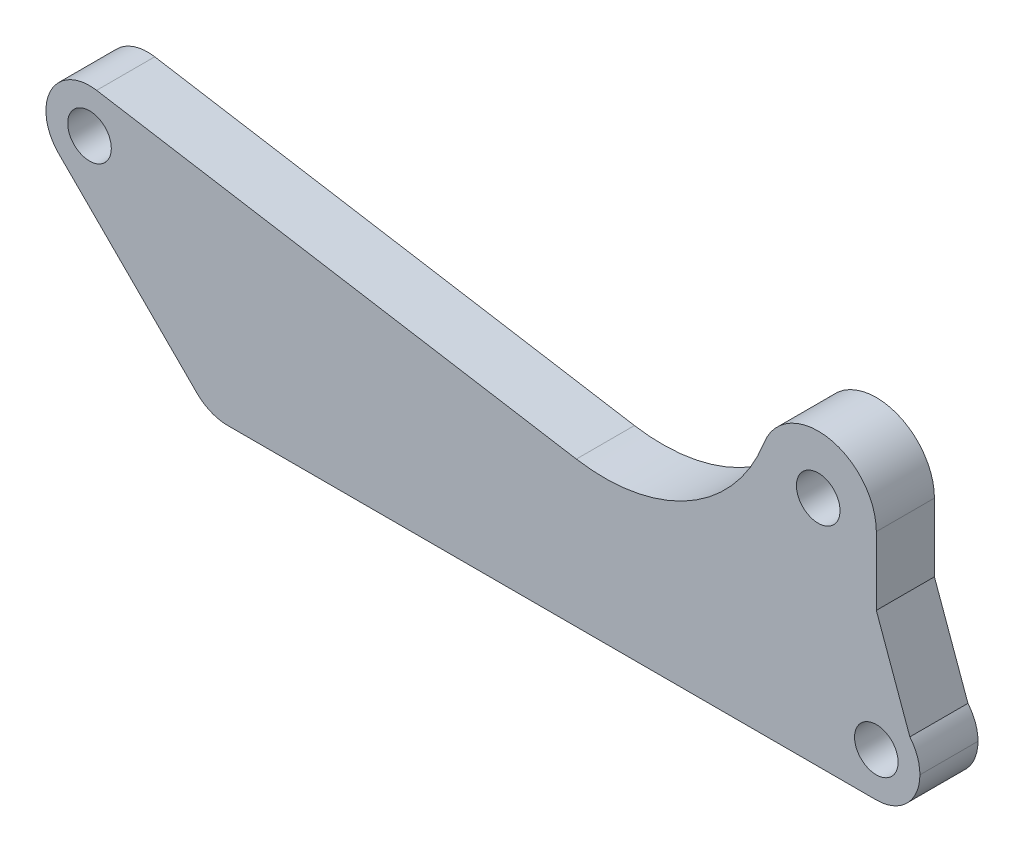
ISO-10303-21;
HEADER;
FILE_DESCRIPTION(('STEP AP214'),'2;1');
FILE_NAME('part.step','',(''),(''),'','','');
FILE_SCHEMA(('AUTOMOTIVE_DESIGN { 1 0 10303 214 1 1 1 1 }'));
ENDSEC;
DATA;
#1=APPLICATION_CONTEXT('core data for automotive mechanical design processes');
#2=APPLICATION_PROTOCOL_DEFINITION('international standard','automotive_design',2000,#1);
#3=PRODUCT_CONTEXT('',#1,'mechanical');
#4=PRODUCT('Part','Part','',(#3));
#5=PRODUCT_RELATED_PRODUCT_CATEGORY('part','',(#4));
#6=PRODUCT_DEFINITION_FORMATION('','',#4);
#7=PRODUCT_DEFINITION_CONTEXT('part definition',#1,'design');
#8=PRODUCT_DEFINITION('design','',#6,#7);
#9=PRODUCT_DEFINITION_SHAPE('','',#8);
#10=(LENGTH_UNIT() NAMED_UNIT(*) SI_UNIT(.MILLI.,.METRE.));
#11=(NAMED_UNIT(*) PLANE_ANGLE_UNIT() SI_UNIT($,.RADIAN.));
#12=(NAMED_UNIT(*) SI_UNIT($,.STERADIAN.) SOLID_ANGLE_UNIT());
#13=UNCERTAINTY_MEASURE_WITH_UNIT(LENGTH_MEASURE(1.E-05),#10,'distance_accuracy_value','');
#14=(GEOMETRIC_REPRESENTATION_CONTEXT(3) GLOBAL_UNCERTAINTY_ASSIGNED_CONTEXT((#13)) GLOBAL_UNIT_ASSIGNED_CONTEXT((#10,
#11,#12)) REPRESENTATION_CONTEXT('',''));
#15=CARTESIAN_POINT('',(0.,0.,0.));
#16=DIRECTION('',(0.,0.,1.));
#17=DIRECTION('',(1.,0.,0.));
#18=AXIS2_PLACEMENT_3D('',#15,#16,#17);
#19=CARTESIAN_POINT('',(-8.27098450185369,12.5136251889729,4.));
#20=DIRECTION('',(0.,0.,-1.));
#21=DIRECTION('',(-1.,0.,0.));
#22=AXIS2_PLACEMENT_3D('',#19,#20,#21);
#23=PLANE('',#22);
#24=DIRECTION('',(0.707106781186552,-0.707106781186543,0.));
#25=VECTOR('',#24,1.);
#26=CARTESIAN_POINT('',(0.,0.,4.));
#27=LINE('',#26,#25);
#28=CARTESIAN_POINT('',(-10.3923048454133,10.3923048454132,4.));
#29=VERTEX_POINT('',#28);
#30=CARTESIAN_POINT('',(-0.878679656440355,0.878679656440345,4.));
#31=VERTEX_POINT('',#30);
#32=EDGE_CURVE('E178',#29,#31,#27,.T.);
#33=ORIENTED_EDGE('',*,*,#32,.T.);
#34=CARTESIAN_POINT('',(1.24264068711928,3.,4.));
#35=DIRECTION('',(0.,0.,-1.));
#36=DIRECTION('',(-1.,0.,0.));
#37=AXIS2_PLACEMENT_3D('',#34,#35,#36);
#38=CIRCLE('',#37,3.);
#39=CARTESIAN_POINT('',(1.24264068711928,0.,4.));
#40=VERTEX_POINT('',#39);
#41=EDGE_CURVE('E206',#31,#40,#38,.F.);
#42=ORIENTED_EDGE('',*,*,#41,.T.);
#43=DIRECTION('',(1.,0.,0.));
#44=VECTOR('',#43,1.);
#45=CARTESIAN_POINT('',(0.,0.,4.));
#46=LINE('',#45,#44);
#47=CARTESIAN_POINT('',(45.89995730059,0.,4.));
#48=VERTEX_POINT('',#47);
#49=EDGE_CURVE('E133',#40,#48,#46,.T.);
#50=ORIENTED_EDGE('',*,*,#49,.T.);
#51=CARTESIAN_POINT('',(45.89995730059,3.,4.));
#52=DIRECTION('',(0.,0.,-1.));
#53=DIRECTION('',(-1.,0.,0.));
#54=AXIS2_PLACEMENT_3D('',#51,#52,#53);
#55=CIRCLE('',#54,3.);
#56=CARTESIAN_POINT('',(48.89995730059,3.,4.));
#57=VERTEX_POINT('',#56);
#58=EDGE_CURVE('E204',#48,#57,#55,.F.);
#59=ORIENTED_EDGE('',*,*,#58,.T.);
#60=CARTESIAN_POINT('',(45.89995730059,3.,4.));
#61=DIRECTION('',(0.,0.,-1.));
#62=DIRECTION('',(-1.,0.,0.));
#63=AXIS2_PLACEMENT_3D('',#60,#61,#62);
#64=CIRCLE('',#63,3.);
#65=CARTESIAN_POINT('',(48.2076496082823,4.91691319913492,4.));
#66=VERTEX_POINT('',#65);
#67=EDGE_CURVE('E202',#57,#66,#64,.F.);
#68=ORIENTED_EDGE('',*,*,#67,.T.);
#69=DIRECTION('',(-0.339683110243367,0.940539943125964,0.));
#70=VECTOR('',#69,1.);
#71=CARTESIAN_POINT('',(39.2638445534785,29.6811880303093,4.));
#72=LINE('',#71,#70);
#73=CARTESIAN_POINT('',(45.89995730059,11.3066238629183,4.));
#74=VERTEX_POINT('',#73);
#75=EDGE_CURVE('E11',#66,#74,#72,.T.);
#76=ORIENTED_EDGE('',*,*,#75,.T.);
#77=DIRECTION('',(0.,1.,0.));
#78=VECTOR('',#77,1.);
#79=CARTESIAN_POINT('',(45.89995730059,6.,4.));
#80=LINE('',#79,#78);
#81=CARTESIAN_POINT('',(45.89995730059,16.,4.));
#82=VERTEX_POINT('',#81);
#83=EDGE_CURVE('E122',#74,#82,#80,.T.);
#84=ORIENTED_EDGE('',*,*,#83,.T.);
#85=CARTESIAN_POINT('',(41.89995730059,16.,4.));
#86=DIRECTION('',(0.,0.,1.));
#87=DIRECTION('',(-1.,0.,0.));
#88=AXIS2_PLACEMENT_3D('',#85,#86,#87);
#89=CIRCLE('',#88,4.);
#90=CARTESIAN_POINT('',(38.1611913827208,17.4218401497283,4.));
#91=VERTEX_POINT('',#90);
#92=EDGE_CURVE('E127',#82,#91,#89,.T.);
#93=ORIENTED_EDGE('',*,*,#92,.T.);
#94=CARTESIAN_POINT('',(27.1687942559165,21.6022119408448,4.));
#95=DIRECTION('',(0.,0.,-1.));
#96=DIRECTION('',(1.,0.,0.));
#97=AXIS2_PLACEMENT_3D('',#94,#95,#96);
#98=CIRCLE('',#97,11.7604550466952);
#99=CARTESIAN_POINT('',(25.2460407654616,10.,4.));
#100=VERTEX_POINT('',#99);
#101=EDGE_CURVE('E148',#91,#100,#98,.T.);
#102=ORIENTED_EDGE('',*,*,#101,.T.);
#103=DIRECTION('',(-0.986544474238278,0.163493120191399,0.));
#104=VECTOR('',#103,1.);
#105=CARTESIAN_POINT('',(-7.7805051412795,15.4732586116877,4.));
#106=LINE('',#105,#104);
#107=CARTESIAN_POINT('',(-7.7805051412795,15.4732586116877,4.));
#108=VERTEX_POINT('',#107);
#109=EDGE_CURVE('E152',#100,#108,#106,.T.);
#110=ORIENTED_EDGE('',*,*,#109,.T.);
#111=CARTESIAN_POINT('',(-8.27098450185369,12.5136251889729,4.));
#112=DIRECTION('',(0.,0.,1.));
#113=DIRECTION('',(-1.,0.,0.));
#114=AXIS2_PLACEMENT_3D('',#111,#112,#113);
#115=CIRCLE('',#114,3.);
#116=EDGE_CURVE('E157',#108,#29,#115,.T.);
#117=ORIENTED_EDGE('',*,*,#116,.T.);
#118=EDGE_LOOP('',(#33,#42,#50,#59,#68,#76,#84,#93,#102,#110,#117));
#119=FACE_BOUND('',#118,.T.);
#120=CARTESIAN_POINT('',(41.89995730059,16.,4.));
#121=DIRECTION('',(0.,0.,1.));
#122=DIRECTION('',(1.,0.,0.));
#123=AXIS2_PLACEMENT_3D('',#120,#121,#122);
#124=CIRCLE('',#123,1.5);
#125=CARTESIAN_POINT('',(43.39995730059,16.,4.));
#126=VERTEX_POINT('',#125);
#127=EDGE_CURVE('E164',#126,#126,#124,.T.);
#128=ORIENTED_EDGE('',*,*,#127,.F.);
#129=EDGE_LOOP('',(#128));
#130=FACE_BOUND('',#129,.T.);
#131=CARTESIAN_POINT('',(-8.27098450185369,12.5136251889729,4.));
#132=DIRECTION('',(0.,0.,1.));
#133=DIRECTION('',(1.,0.,0.));
#134=AXIS2_PLACEMENT_3D('',#131,#132,#133);
#135=CIRCLE('',#134,1.50000000000001);
#136=CARTESIAN_POINT('',(-6.77098450185369,12.5136251889729,4.));
#137=VERTEX_POINT('',#136);
#138=EDGE_CURVE('E245',#137,#137,#135,.T.);
#139=ORIENTED_EDGE('',*,*,#138,.F.);
#140=EDGE_LOOP('',(#139));
#141=FACE_BOUND('',#140,.T.);
#142=CARTESIAN_POINT('',(45.89995730059,2.99999999999996,4.));
#143=DIRECTION('',(0.,0.,1.));
#144=DIRECTION('',(1.,0.,0.));
#145=AXIS2_PLACEMENT_3D('',#142,#143,#144);
#146=CIRCLE('',#145,1.50000000000002);
#147=CARTESIAN_POINT('',(47.39995730059,2.99999999999996,4.));
#148=VERTEX_POINT('',#147);
#149=EDGE_CURVE('E251',#148,#148,#146,.T.);
#150=ORIENTED_EDGE('',*,*,#149,.F.);
#151=EDGE_LOOP('',(#150));
#152=FACE_BOUND('',#151,.T.);
#153=ADVANCED_FACE('F39',(#119,#130,#141,#152),#23,.F.);
#154=CARTESIAN_POINT('',(-8.27098450185369,12.5136251889729,0.));
#155=DIRECTION('',(0.,0.,-1.));
#156=DIRECTION('',(-1.,0.,0.));
#157=AXIS2_PLACEMENT_3D('',#154,#155,#156);
#158=PLANE('',#157);
#159=CARTESIAN_POINT('',(-8.27098450185369,12.5136251889729,0.));
#160=DIRECTION('',(0.,0.,1.));
#161=DIRECTION('',(1.,0.,0.));
#162=AXIS2_PLACEMENT_3D('',#159,#160,#161);
#163=CIRCLE('',#162,1.50000000000001);
#164=CARTESIAN_POINT('',(-6.77098450185369,12.5136251889729,0.));
#165=VERTEX_POINT('',#164);
#166=EDGE_CURVE('E248',#165,#165,#163,.T.);
#167=ORIENTED_EDGE('',*,*,#166,.T.);
#168=EDGE_LOOP('',(#167));
#169=FACE_BOUND('',#168,.T.);
#170=DIRECTION('',(1.,0.,0.));
#171=VECTOR('',#170,1.);
#172=CARTESIAN_POINT('',(0.,0.,0.));
#173=LINE('',#172,#171);
#174=CARTESIAN_POINT('',(1.24264068711928,0.,0.));
#175=VERTEX_POINT('',#174);
#176=CARTESIAN_POINT('',(45.89995730059,0.,0.));
#177=VERTEX_POINT('',#176);
#178=EDGE_CURVE('E163',#175,#177,#173,.T.);
#179=ORIENTED_EDGE('',*,*,#178,.F.);
#180=CARTESIAN_POINT('',(1.24264068711928,3.,0.));
#181=DIRECTION('',(0.,0.,-1.));
#182=DIRECTION('',(-1.,0.,0.));
#183=AXIS2_PLACEMENT_3D('',#180,#181,#182);
#184=CIRCLE('',#183,3.);
#185=CARTESIAN_POINT('',(-0.878679656440355,0.878679656440345,0.));
#186=VERTEX_POINT('',#185);
#187=EDGE_CURVE('E198',#175,#186,#184,.T.);
#188=ORIENTED_EDGE('',*,*,#187,.T.);
#189=DIRECTION('',(0.707106781186552,-0.707106781186543,0.));
#190=VECTOR('',#189,1.);
#191=CARTESIAN_POINT('',(0.,0.,0.));
#192=LINE('',#191,#190);
#193=CARTESIAN_POINT('',(-10.3923048454133,10.3923048454132,0.));
#194=VERTEX_POINT('',#193);
#195=EDGE_CURVE('E160',#194,#186,#192,.T.);
#196=ORIENTED_EDGE('',*,*,#195,.F.);
#197=CARTESIAN_POINT('',(-8.27098450185369,12.5136251889729,0.));
#198=DIRECTION('',(0.,0.,1.));
#199=DIRECTION('',(-1.,0.,0.));
#200=AXIS2_PLACEMENT_3D('',#197,#198,#199);
#201=CIRCLE('',#200,3.);
#202=CARTESIAN_POINT('',(-7.7805051412795,15.4732586116877,0.));
#203=VERTEX_POINT('',#202);
#204=EDGE_CURVE('E176',#203,#194,#201,.T.);
#205=ORIENTED_EDGE('',*,*,#204,.F.);
#206=DIRECTION('',(-0.986544474238278,0.163493120191399,0.));
#207=VECTOR('',#206,1.);
#208=CARTESIAN_POINT('',(-7.7805051412795,15.4732586116877,0.));
#209=LINE('',#208,#207);
#210=CARTESIAN_POINT('',(25.2460407654616,10.,0.));
#211=VERTEX_POINT('',#210);
#212=EDGE_CURVE('E174',#211,#203,#209,.T.);
#213=ORIENTED_EDGE('',*,*,#212,.F.);
#214=CARTESIAN_POINT('',(27.1687942559165,21.6022119408448,0.));
#215=DIRECTION('',(0.,0.,-1.));
#216=DIRECTION('',(1.,0.,0.));
#217=AXIS2_PLACEMENT_3D('',#214,#215,#216);
#218=CIRCLE('',#217,11.7604550466952);
#219=CARTESIAN_POINT('',(38.1611913827208,17.4218401497283,0.));
#220=VERTEX_POINT('',#219);
#221=EDGE_CURVE('E171',#220,#211,#218,.T.);
#222=ORIENTED_EDGE('',*,*,#221,.F.);
#223=CARTESIAN_POINT('',(41.89995730059,16.,0.));
#224=DIRECTION('',(0.,0.,1.));
#225=DIRECTION('',(-1.,0.,0.));
#226=AXIS2_PLACEMENT_3D('',#223,#224,#225);
#227=CIRCLE('',#226,4.);
#228=CARTESIAN_POINT('',(45.89995730059,16.,0.));
#229=VERTEX_POINT('',#228);
#230=EDGE_CURVE('E168',#229,#220,#227,.T.);
#231=ORIENTED_EDGE('',*,*,#230,.F.);
#232=DIRECTION('',(0.,1.,0.));
#233=VECTOR('',#232,1.);
#234=CARTESIAN_POINT('',(45.89995730059,6.,0.));
#235=LINE('',#234,#233);
#236=CARTESIAN_POINT('',(45.89995730059,11.3066238629183,0.));
#237=VERTEX_POINT('',#236);
#238=EDGE_CURVE('E138',#237,#229,#235,.T.);
#239=ORIENTED_EDGE('',*,*,#238,.F.);
#240=DIRECTION('',(0.339683110243367,-0.940539943125964,0.));
#241=VECTOR('',#240,1.);
#242=CARTESIAN_POINT('',(45.89995730059,11.3066238629183,0.));
#243=LINE('',#242,#241);
#244=CARTESIAN_POINT('',(48.2076496082823,4.91691319913492,0.));
#245=VERTEX_POINT('',#244);
#246=EDGE_CURVE('E47',#237,#245,#243,.T.);
#247=ORIENTED_EDGE('',*,*,#246,.T.);
#248=CARTESIAN_POINT('',(45.89995730059,3.,0.));
#249=DIRECTION('',(0.,0.,-1.));
#250=DIRECTION('',(-1.,0.,0.));
#251=AXIS2_PLACEMENT_3D('',#248,#249,#250);
#252=CIRCLE('',#251,3.);
#253=CARTESIAN_POINT('',(48.89995730059,3.,0.));
#254=VERTEX_POINT('',#253);
#255=EDGE_CURVE('E194',#245,#254,#252,.T.);
#256=ORIENTED_EDGE('',*,*,#255,.T.);
#257=CARTESIAN_POINT('',(45.89995730059,3.,0.));
#258=DIRECTION('',(0.,0.,-1.));
#259=DIRECTION('',(-1.,0.,0.));
#260=AXIS2_PLACEMENT_3D('',#257,#258,#259);
#261=CIRCLE('',#260,3.);
#262=EDGE_CURVE('E196',#254,#177,#261,.T.);
#263=ORIENTED_EDGE('',*,*,#262,.T.);
#264=EDGE_LOOP('',(#179,#188,#196,#205,#213,#222,#231,#239,#247,#256,#263));
#265=FACE_BOUND('',#264,.T.);
#266=CARTESIAN_POINT('',(41.89995730059,16.,0.));
#267=DIRECTION('',(0.,0.,1.));
#268=DIRECTION('',(1.,0.,0.));
#269=AXIS2_PLACEMENT_3D('',#266,#267,#268);
#270=CIRCLE('',#269,1.5);
#271=CARTESIAN_POINT('',(43.39995730059,16.,0.));
#272=VERTEX_POINT('',#271);
#273=EDGE_CURVE('E241',#272,#272,#270,.T.);
#274=ORIENTED_EDGE('',*,*,#273,.T.);
#275=EDGE_LOOP('',(#274));
#276=FACE_BOUND('',#275,.T.);
#277=CARTESIAN_POINT('',(45.89995730059,2.99999999999996,0.));
#278=DIRECTION('',(0.,0.,1.));
#279=DIRECTION('',(1.,0.,0.));
#280=AXIS2_PLACEMENT_3D('',#277,#278,#279);
#281=CIRCLE('',#280,1.50000000000002);
#282=CARTESIAN_POINT('',(47.39995730059,2.99999999999996,0.));
#283=VERTEX_POINT('',#282);
#284=EDGE_CURVE('E212',#283,#283,#281,.T.);
#285=ORIENTED_EDGE('',*,*,#284,.T.);
#286=EDGE_LOOP('',(#285));
#287=FACE_BOUND('',#286,.T.);
#288=ADVANCED_FACE('F216',(#169,#265,#276,#287),#158,.T.);
#289=CARTESIAN_POINT('',(0.,0.,4.));
#290=DIRECTION('',(0.707106781186543,0.707106781186552,0.));
#291=DIRECTION('',(-0.707106781186552,0.707106781186543,0.));
#292=AXIS2_PLACEMENT_3D('',#289,#290,#291);
#293=PLANE('',#292);
#294=ORIENTED_EDGE('',*,*,#195,.T.);
#295=DIRECTION('',(0.,0.,-1.));
#296=VECTOR('',#295,1.);
#297=CARTESIAN_POINT('',(-0.878679656440355,0.878679656440345,4.));
#298=LINE('',#297,#296);
#299=EDGE_CURVE('E200',#186,#31,#298,.F.);
#300=ORIENTED_EDGE('',*,*,#299,.T.);
#301=ORIENTED_EDGE('',*,*,#32,.F.);
#302=DIRECTION('',(0.,0.,-1.));
#303=VECTOR('',#302,1.);
#304=CARTESIAN_POINT('',(-10.3923048454133,10.3923048454132,4.));
#305=LINE('',#304,#303);
#306=EDGE_CURVE('E159',#29,#194,#305,.T.);
#307=ORIENTED_EDGE('',*,*,#306,.T.);
#308=EDGE_LOOP('',(#294,#300,#301,#307));
#309=FACE_BOUND('',#308,.T.);
#310=ADVANCED_FACE('F235',(#309),#293,.F.);
#311=CARTESIAN_POINT('',(0.,0.,4.));
#312=DIRECTION('',(0.,1.,0.));
#313=DIRECTION('',(0.,0.,1.));
#314=AXIS2_PLACEMENT_3D('',#311,#312,#313);
#315=PLANE('',#314);
#316=ORIENTED_EDGE('',*,*,#49,.F.);
#317=DIRECTION('',(0.,0.,-1.));
#318=VECTOR('',#317,1.);
#319=CARTESIAN_POINT('',(1.24264068711928,0.,4.));
#320=LINE('',#319,#318);
#321=EDGE_CURVE('E191',#40,#175,#320,.T.);
#322=ORIENTED_EDGE('',*,*,#321,.T.);
#323=ORIENTED_EDGE('',*,*,#178,.T.);
#324=DIRECTION('',(0.,0.,-1.));
#325=VECTOR('',#324,1.);
#326=CARTESIAN_POINT('',(45.89995730059,0.,4.));
#327=LINE('',#326,#325);
#328=EDGE_CURVE('E141',#177,#48,#327,.F.);
#329=ORIENTED_EDGE('',*,*,#328,.T.);
#330=EDGE_LOOP('',(#316,#322,#323,#329));
#331=FACE_BOUND('',#330,.T.);
#332=ADVANCED_FACE('F283',(#331),#315,.F.);
#333=CARTESIAN_POINT('',(45.89995730059,6.,4.));
#334=DIRECTION('',(-1.,0.,0.));
#335=DIRECTION('',(0.,0.,1.));
#336=AXIS2_PLACEMENT_3D('',#333,#334,#335);
#337=PLANE('',#336);
#338=ORIENTED_EDGE('',*,*,#83,.F.);
#339=DIRECTION('',(0.,0.,-1.));
#340=VECTOR('',#339,1.);
#341=CARTESIAN_POINT('',(45.89995730059,11.3066238629183,4.));
#342=LINE('',#341,#340);
#343=EDGE_CURVE('E208',#74,#237,#342,.T.);
#344=ORIENTED_EDGE('',*,*,#343,.T.);
#345=ORIENTED_EDGE('',*,*,#238,.T.);
#346=DIRECTION('',(0.,0.,-1.));
#347=VECTOR('',#346,1.);
#348=CARTESIAN_POINT('',(45.89995730059,16.,4.));
#349=LINE('',#348,#347);
#350=EDGE_CURVE('E136',#82,#229,#349,.T.);
#351=ORIENTED_EDGE('',*,*,#350,.F.);
#352=EDGE_LOOP('',(#338,#344,#345,#351));
#353=FACE_BOUND('',#352,.T.);
#354=ADVANCED_FACE('F137',(#353),#337,.F.);
#355=CARTESIAN_POINT('',(41.89995730059,16.,4.));
#356=DIRECTION('',(0.,0.,-1.));
#357=DIRECTION('',(-1.,0.,0.));
#358=AXIS2_PLACEMENT_3D('',#355,#356,#357);
#359=CYLINDRICAL_SURFACE('',#358,4.);
#360=ORIENTED_EDGE('',*,*,#230,.T.);
#361=DIRECTION('',(0.,0.,-1.));
#362=VECTOR('',#361,1.);
#363=CARTESIAN_POINT('',(38.1611913827208,17.4218401497283,4.));
#364=LINE('',#363,#362);
#365=EDGE_CURVE('E142',#91,#220,#364,.T.);
#366=ORIENTED_EDGE('',*,*,#365,.F.);
#367=ORIENTED_EDGE('',*,*,#92,.F.);
#368=ORIENTED_EDGE('',*,*,#350,.T.);
#369=EDGE_LOOP('',(#360,#366,#367,#368));
#370=FACE_BOUND('',#369,.T.);
#371=ADVANCED_FACE('F144',(#370),#359,.T.);
#372=CARTESIAN_POINT('',(27.1687942559165,21.6022119408448,4.));
#373=DIRECTION('',(0.,0.,-1.));
#374=DIRECTION('',(-1.,0.,0.));
#375=AXIS2_PLACEMENT_3D('',#372,#373,#374);
#376=CYLINDRICAL_SURFACE('',#375,11.7604550466952);
#377=ORIENTED_EDGE('',*,*,#221,.T.);
#378=DIRECTION('',(0.,0.,-1.));
#379=VECTOR('',#378,1.);
#380=CARTESIAN_POINT('',(25.2460407654616,10.,4.));
#381=LINE('',#380,#379);
#382=EDGE_CURVE('E184',#100,#211,#381,.T.);
#383=ORIENTED_EDGE('',*,*,#382,.F.);
#384=ORIENTED_EDGE('',*,*,#101,.F.);
#385=ORIENTED_EDGE('',*,*,#365,.T.);
#386=EDGE_LOOP('',(#377,#383,#384,#385));
#387=FACE_BOUND('',#386,.T.);
#388=ADVANCED_FACE('F221',(#387),#376,.F.);
#389=CARTESIAN_POINT('',(-7.7805051412795,15.4732586116877,4.));
#390=DIRECTION('',(-0.163493120191399,-0.986544474238278,0.));
#391=DIRECTION('',(0.986544474238278,-0.163493120191399,0.));
#392=AXIS2_PLACEMENT_3D('',#389,#390,#391);
#393=PLANE('',#392);
#394=ORIENTED_EDGE('',*,*,#212,.T.);
#395=DIRECTION('',(0.,0.,-1.));
#396=VECTOR('',#395,1.);
#397=CARTESIAN_POINT('',(-7.7805051412795,15.4732586116877,4.));
#398=LINE('',#397,#396);
#399=EDGE_CURVE('E181',#108,#203,#398,.T.);
#400=ORIENTED_EDGE('',*,*,#399,.F.);
#401=ORIENTED_EDGE('',*,*,#109,.F.);
#402=ORIENTED_EDGE('',*,*,#382,.T.);
#403=EDGE_LOOP('',(#394,#400,#401,#402));
#404=FACE_BOUND('',#403,.T.);
#405=ADVANCED_FACE('F228',(#404),#393,.F.);
#406=CARTESIAN_POINT('',(-8.27098450185369,12.5136251889729,4.));
#407=DIRECTION('',(0.,0.,-1.));
#408=DIRECTION('',(-1.,0.,0.));
#409=AXIS2_PLACEMENT_3D('',#406,#407,#408);
#410=CYLINDRICAL_SURFACE('',#409,3.);
#411=ORIENTED_EDGE('',*,*,#204,.T.);
#412=ORIENTED_EDGE('',*,*,#306,.F.);
#413=ORIENTED_EDGE('',*,*,#116,.F.);
#414=ORIENTED_EDGE('',*,*,#399,.T.);
#415=EDGE_LOOP('',(#411,#412,#413,#414));
#416=FACE_BOUND('',#415,.T.);
#417=ADVANCED_FACE('F231',(#416),#410,.T.);
#418=CARTESIAN_POINT('',(41.89995730059,16.,4.));
#419=DIRECTION('',(0.,0.,-1.));
#420=DIRECTION('',(-1.,0.,0.));
#421=AXIS2_PLACEMENT_3D('',#418,#419,#420);
#422=CYLINDRICAL_SURFACE('',#421,1.5);
#423=ORIENTED_EDGE('',*,*,#127,.T.);
#424=EDGE_LOOP('',(#423));
#425=FACE_BOUND('',#424,.T.);
#426=ORIENTED_EDGE('',*,*,#273,.F.);
#427=EDGE_LOOP('',(#426));
#428=FACE_BOUND('',#427,.T.);
#429=ADVANCED_FACE('F270',(#425,#428),#422,.F.);
#430=CARTESIAN_POINT('',(-8.27098450185369,12.5136251889729,4.));
#431=DIRECTION('',(0.,0.,-1.));
#432=DIRECTION('',(-1.,0.,0.));
#433=AXIS2_PLACEMENT_3D('',#430,#431,#432);
#434=CYLINDRICAL_SURFACE('',#433,1.50000000000001);
#435=ORIENTED_EDGE('',*,*,#138,.T.);
#436=EDGE_LOOP('',(#435));
#437=FACE_BOUND('',#436,.T.);
#438=ORIENTED_EDGE('',*,*,#166,.F.);
#439=EDGE_LOOP('',(#438));
#440=FACE_BOUND('',#439,.T.);
#441=ADVANCED_FACE('F350',(#437,#440),#434,.F.);
#442=CARTESIAN_POINT('',(45.89995730059,2.99999999999996,4.));
#443=DIRECTION('',(0.,0.,-1.));
#444=DIRECTION('',(-1.,0.,0.));
#445=AXIS2_PLACEMENT_3D('',#442,#443,#444);
#446=CYLINDRICAL_SURFACE('',#445,1.50000000000002);
#447=ORIENTED_EDGE('',*,*,#149,.T.);
#448=EDGE_LOOP('',(#447));
#449=FACE_BOUND('',#448,.T.);
#450=ORIENTED_EDGE('',*,*,#284,.F.);
#451=EDGE_LOOP('',(#450));
#452=FACE_BOUND('',#451,.T.);
#453=ADVANCED_FACE('F259',(#449,#452),#446,.F.);
#454=CARTESIAN_POINT('',(1.24264068711928,3.,4.));
#455=DIRECTION('',(0.,0.,-1.));
#456=DIRECTION('',(-1.,0.,0.));
#457=AXIS2_PLACEMENT_3D('',#454,#455,#456);
#458=CYLINDRICAL_SURFACE('',#457,3.);
#459=ORIENTED_EDGE('',*,*,#41,.F.);
#460=ORIENTED_EDGE('',*,*,#299,.F.);
#461=ORIENTED_EDGE('',*,*,#187,.F.);
#462=ORIENTED_EDGE('',*,*,#321,.F.);
#463=EDGE_LOOP('',(#459,#460,#461,#462));
#464=FACE_BOUND('',#463,.T.);
#465=ADVANCED_FACE('F289',(#464),#458,.T.);
#466=CARTESIAN_POINT('',(45.89995730059,3.,4.));
#467=DIRECTION('',(0.,0.,-1.));
#468=DIRECTION('',(-1.,0.,0.));
#469=AXIS2_PLACEMENT_3D('',#466,#467,#468);
#470=CYLINDRICAL_SURFACE('',#469,3.);
#471=ORIENTED_EDGE('',*,*,#255,.F.);
#472=DIRECTION('',(0.,0.,-1.));
#473=VECTOR('',#472,1.);
#474=CARTESIAN_POINT('',(48.2076496082823,4.91691319913492,4.));
#475=LINE('',#474,#473);
#476=EDGE_CURVE('E60',#245,#66,#475,.F.);
#477=ORIENTED_EDGE('',*,*,#476,.T.);
#478=ORIENTED_EDGE('',*,*,#67,.F.);
#479=DIRECTION('',(0.,0.,-1.));
#480=VECTOR('',#479,1.);
#481=CARTESIAN_POINT('',(48.89995730059,3.,4.));
#482=LINE('',#481,#480);
#483=EDGE_CURVE('E209',#254,#57,#482,.F.);
#484=ORIENTED_EDGE('',*,*,#483,.F.);
#485=EDGE_LOOP('',(#471,#477,#478,#484));
#486=FACE_BOUND('',#485,.T.);
#487=ADVANCED_FACE('F292',(#486),#470,.T.);
#488=CARTESIAN_POINT('',(45.89995730059,3.,4.));
#489=DIRECTION('',(0.,0.,-1.));
#490=DIRECTION('',(-1.,0.,0.));
#491=AXIS2_PLACEMENT_3D('',#488,#489,#490);
#492=CYLINDRICAL_SURFACE('',#491,3.);
#493=ORIENTED_EDGE('',*,*,#58,.F.);
#494=ORIENTED_EDGE('',*,*,#328,.F.);
#495=ORIENTED_EDGE('',*,*,#262,.F.);
#496=ORIENTED_EDGE('',*,*,#483,.T.);
#497=EDGE_LOOP('',(#493,#494,#495,#496));
#498=FACE_BOUND('',#497,.T.);
#499=ADVANCED_FACE('F294',(#498),#492,.T.);
#500=CARTESIAN_POINT('',(45.89995730059,11.3066238629183,4.));
#501=DIRECTION('',(-0.940539943125964,-0.339683110243367,0.));
#502=DIRECTION('',(0.,0.,-1.));
#503=AXIS2_PLACEMENT_3D('',#500,#501,#502);
#504=PLANE('',#503);
#505=ORIENTED_EDGE('',*,*,#75,.F.);
#506=ORIENTED_EDGE('',*,*,#476,.F.);
#507=ORIENTED_EDGE('',*,*,#246,.F.);
#508=ORIENTED_EDGE('',*,*,#343,.F.);
#509=EDGE_LOOP('',(#505,#506,#507,#508));
#510=FACE_BOUND('',#509,.T.);
#511=ADVANCED_FACE('F41',(#510),#504,.F.);
#512=CLOSED_SHELL('',(#153,#288,#310,#332,#354,#371,#388,#405,#417,#429,#441,#453,#465,#487,
#499,#511));
#513=MANIFOLD_SOLID_BREP('B2',#512);
#514=ADVANCED_BREP_SHAPE_REPRESENTATION('',(#18,#513),#14);
#515=SHAPE_DEFINITION_REPRESENTATION(#9,#514);
ENDSEC;
END-ISO-10303-21;
